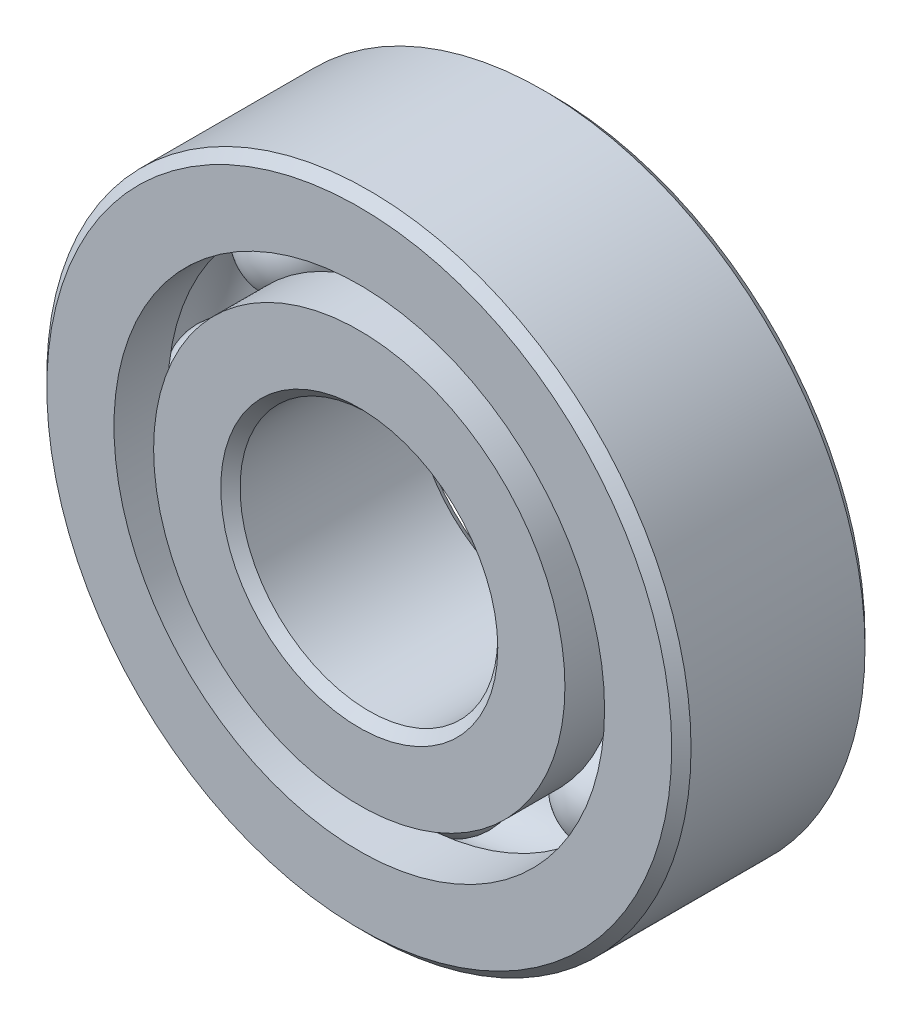
ISO-10303-21;
HEADER;
FILE_DESCRIPTION(('STEP AP214'),'2;1');
FILE_NAME('part.step','',(''),(''),'','','');
FILE_SCHEMA(('AUTOMOTIVE_DESIGN { 1 0 10303 214 1 1 1 1 }'));
ENDSEC;
DATA;
#1=APPLICATION_CONTEXT('core data for automotive mechanical design processes');
#2=APPLICATION_PROTOCOL_DEFINITION('international standard','automotive_design',2000,#1);
#3=PRODUCT_CONTEXT('',#1,'mechanical');
#4=PRODUCT('Part','Part','',(#3));
#5=PRODUCT_RELATED_PRODUCT_CATEGORY('part','',(#4));
#6=PRODUCT_DEFINITION_FORMATION('','',#4);
#7=PRODUCT_DEFINITION_CONTEXT('part definition',#1,'design');
#8=PRODUCT_DEFINITION('design','',#6,#7);
#9=PRODUCT_DEFINITION_SHAPE('','',#8);
#10=(LENGTH_UNIT() NAMED_UNIT(*) SI_UNIT(.MILLI.,.METRE.));
#11=(NAMED_UNIT(*) PLANE_ANGLE_UNIT() SI_UNIT($,.RADIAN.));
#12=(NAMED_UNIT(*) SI_UNIT($,.STERADIAN.) SOLID_ANGLE_UNIT());
#13=UNCERTAINTY_MEASURE_WITH_UNIT(LENGTH_MEASURE(1.E-05),#10,'distance_accuracy_value','');
#14=(GEOMETRIC_REPRESENTATION_CONTEXT(3) GLOBAL_UNCERTAINTY_ASSIGNED_CONTEXT((#13)) GLOBAL_UNIT_ASSIGNED_CONTEXT((#10,
#11,#12)) REPRESENTATION_CONTEXT('',''));
#15=CARTESIAN_POINT('',(0.,0.,0.));
#16=DIRECTION('',(0.,0.,1.));
#17=DIRECTION('',(1.,0.,0.));
#18=AXIS2_PLACEMENT_3D('',#15,#16,#17);
#19=CARTESIAN_POINT('',(-3.92886205296771,3.9288620529678,0.));
#20=DIRECTION('',(0.,0.,1.));
#21=DIRECTION('',(-0.707106781186539,0.707106781186556,0.));
#22=AXIS2_PLACEMENT_3D('',#19,#20,#21);
#23=SPHERICAL_SURFACE('',#22,1.1656174839975);
#24=CARTESIAN_POINT('',(-3.92886205296771,3.9288620529678,1.16561748399749));
#25=VERTEX_POINT('',#24);
#26=VERTEX_LOOP('',#25);
#27=FACE_BOUND('',#26,.T.);
#28=ADVANCED_FACE('F39',(#27),#23,.T.);
#29=CLOSED_SHELL('',(#28));
#30=MANIFOLD_SOLID_BREP('B2',#29);
#31=CARTESIAN_POINT('',(-5.55625,0.,0.));
#32=DIRECTION('',(0.,0.,1.));
#33=DIRECTION('',(-1.,0.,0.));
#34=AXIS2_PLACEMENT_3D('',#31,#32,#33);
#35=SPHERICAL_SURFACE('',#34,1.1656174839975);
#36=CARTESIAN_POINT('',(-5.55625,0.,1.16561748399749));
#37=VERTEX_POINT('',#36);
#38=VERTEX_LOOP('',#37);
#39=FACE_BOUND('',#38,.T.);
#40=ADVANCED_FACE('F59',(#39),#35,.T.);
#41=CLOSED_SHELL('',(#40));
#42=MANIFOLD_SOLID_BREP('B6',#41);
#43=CARTESIAN_POINT('',(-3.92886205296779,-3.92886205296772,0.));
#44=DIRECTION('',(0.,0.,1.));
#45=DIRECTION('',(-0.707106781186554,-0.707106781186541,0.));
#46=AXIS2_PLACEMENT_3D('',#43,#44,#45);
#47=SPHERICAL_SURFACE('',#46,1.1656174839975);
#48=CARTESIAN_POINT('',(-3.92886205296779,-3.92886205296772,1.16561748399749));
#49=VERTEX_POINT('',#48);
#50=VERTEX_LOOP('',#49);
#51=FACE_BOUND('',#50,.T.);
#52=ADVANCED_FACE('F79',(#51),#47,.T.);
#53=CLOSED_SHELL('',(#52));
#54=MANIFOLD_SOLID_BREP('B35',#53);
#55=CARTESIAN_POINT('',(0.,-5.55625,0.));
#56=DIRECTION('',(0.,0.,1.));
#57=DIRECTION('',(0.,-1.,0.));
#58=AXIS2_PLACEMENT_3D('',#55,#56,#57);
#59=SPHERICAL_SURFACE('',#58,1.1656174839975);
#60=CARTESIAN_POINT('',(0.,-5.55625,1.16561748399749));
#61=VERTEX_POINT('',#60);
#62=VERTEX_LOOP('',#61);
#63=FACE_BOUND('',#62,.T.);
#64=ADVANCED_FACE('F99',(#63),#59,.T.);
#65=CLOSED_SHELL('',(#64));
#66=MANIFOLD_SOLID_BREP('B55',#65);
#67=CARTESIAN_POINT('',(3.92886205296773,-3.92886205296777,0.));
#68=DIRECTION('',(0.,0.,1.));
#69=DIRECTION('',(0.707106781186544,-0.707106781186551,0.));
#70=AXIS2_PLACEMENT_3D('',#67,#68,#69);
#71=SPHERICAL_SURFACE('',#70,1.1656174839975);
#72=CARTESIAN_POINT('',(3.92886205296773,-3.92886205296777,1.16561748399749));
#73=VERTEX_POINT('',#72);
#74=VERTEX_LOOP('',#73);
#75=FACE_BOUND('',#74,.T.);
#76=ADVANCED_FACE('F119',(#75),#71,.T.);
#77=CLOSED_SHELL('',(#76));
#78=MANIFOLD_SOLID_BREP('B75',#77);
#79=CARTESIAN_POINT('',(5.55625,0.,0.));
#80=DIRECTION('',(0.,0.,1.));
#81=DIRECTION('',(1.,0.,0.));
#82=AXIS2_PLACEMENT_3D('',#79,#80,#81);
#83=SPHERICAL_SURFACE('',#82,1.1656174839975);
#84=CARTESIAN_POINT('',(5.55625,0.,1.16561748399749));
#85=VERTEX_POINT('',#84);
#86=VERTEX_LOOP('',#85);
#87=FACE_BOUND('',#86,.T.);
#88=ADVANCED_FACE('F139',(#87),#83,.T.);
#89=CLOSED_SHELL('',(#88));
#90=MANIFOLD_SOLID_BREP('B95',#89);
#91=CARTESIAN_POINT('',(3.92886205296776,3.92886205296775,0.));
#92=DIRECTION('',(0.,0.,1.));
#93=DIRECTION('',(0.707106781186549,0.707106781186546,0.));
#94=AXIS2_PLACEMENT_3D('',#91,#92,#93);
#95=SPHERICAL_SURFACE('',#94,1.1656174839975);
#96=CARTESIAN_POINT('',(3.92886205296776,3.92886205296775,1.16561748399749));
#97=VERTEX_POINT('',#96);
#98=VERTEX_LOOP('',#97);
#99=FACE_BOUND('',#98,.T.);
#100=ADVANCED_FACE('F159',(#99),#95,.T.);
#101=CLOSED_SHELL('',(#100));
#102=MANIFOLD_SOLID_BREP('B115',#101);
#103=CARTESIAN_POINT('',(0.,5.55625,0.));
#104=DIRECTION('',(0.,0.,1.));
#105=DIRECTION('',(0.,1.,0.));
#106=AXIS2_PLACEMENT_3D('',#103,#104,#105);
#107=SPHERICAL_SURFACE('',#106,1.1656174839975);
#108=CARTESIAN_POINT('',(0.,5.55625,1.16561748399749));
#109=VERTEX_POINT('',#108);
#110=VERTEX_LOOP('',#109);
#111=FACE_BOUND('',#110,.T.);
#112=ADVANCED_FACE('F181',(#111),#107,.T.);
#113=CLOSED_SHELL('',(#112));
#114=MANIFOLD_SOLID_BREP('B135',#113);
#115=CARTESIAN_POINT('',(0.,5.06778846153847,2.38125));
#116=DIRECTION('',(0.,0.,-1.));
#117=DIRECTION('',(-1.,0.,0.));
#118=AXIS2_PLACEMENT_3D('',#115,#116,#117);
#119=PLANE('',#118);
#120=CARTESIAN_POINT('',(0.,0.,2.38125));
#121=DIRECTION('',(0.,0.,1.));
#122=DIRECTION('',(1.,0.,0.));
#123=AXIS2_PLACEMENT_3D('',#120,#121,#122);
#124=CIRCLE('',#123,3.413125);
#125=CARTESIAN_POINT('',(3.413125,0.,2.38125));
#126=VERTEX_POINT('',#125);
#127=EDGE_CURVE('E228',#126,#126,#124,.T.);
#128=ORIENTED_EDGE('',*,*,#127,.F.);
#129=EDGE_LOOP('',(#128));
#130=FACE_BOUND('',#129,.T.);
#131=CARTESIAN_POINT('',(0.,0.,2.38125));
#132=DIRECTION('',(0.,0.,1.));
#133=DIRECTION('',(1.,0.,0.));
#134=AXIS2_PLACEMENT_3D('',#131,#132,#133);
#135=CIRCLE('',#134,5.06778846153847);
#136=CARTESIAN_POINT('',(5.06778846153847,0.,2.38125));
#137=VERTEX_POINT('',#136);
#138=EDGE_CURVE('E180',#137,#137,#135,.T.);
#139=ORIENTED_EDGE('',*,*,#138,.T.);
#140=EDGE_LOOP('',(#139));
#141=FACE_BOUND('',#140,.T.);
#142=ADVANCED_FACE('F200',(#130,#141),#119,.F.);
#143=CARTESIAN_POINT('',(0.,0.,2.38125));
#144=DIRECTION('',(0.,0.,1.));
#145=DIRECTION('',(1.,0.,0.));
#146=AXIS2_PLACEMENT_3D('',#143,#144,#145);
#147=CYLINDRICAL_SURFACE('',#146,5.06778846153847);
#148=ORIENTED_EDGE('',*,*,#138,.F.);
#149=EDGE_LOOP('',(#148));
#150=FACE_BOUND('',#149,.T.);
#151=CARTESIAN_POINT('',(0.,0.,1.05833333333333));
#152=DIRECTION('',(0.,0.,1.));
#153=DIRECTION('',(1.,0.,0.));
#154=AXIS2_PLACEMENT_3D('',#151,#152,#153);
#155=CIRCLE('',#154,5.06778846153847);
#156=CARTESIAN_POINT('',(5.06778846153847,0.,1.05833333333333));
#157=VERTEX_POINT('',#156);
#158=EDGE_CURVE('E206',#157,#157,#155,.T.);
#159=ORIENTED_EDGE('',*,*,#158,.T.);
#160=EDGE_LOOP('',(#159));
#161=FACE_BOUND('',#160,.T.);
#162=ADVANCED_FACE('F235',(#150,#161),#147,.T.);
#163=CARTESIAN_POINT('',(0.,0.,0.));
#164=DIRECTION('',(0.,0.,1.));
#165=DIRECTION('',(1.,0.,0.));
#166=AXIS2_PLACEMENT_3D('',#163,#164,#165);
#167=TOROIDAL_SURFACE('',#166,5.55625,1.16561748399749);
#168=ORIENTED_EDGE('',*,*,#158,.F.);
#169=EDGE_LOOP('',(#168));
#170=FACE_BOUND('',#169,.T.);
#171=CARTESIAN_POINT('',(0.,0.,-1.05833333333333));
#172=DIRECTION('',(0.,0.,1.));
#173=DIRECTION('',(1.,0.,0.));
#174=AXIS2_PLACEMENT_3D('',#171,#172,#173);
#175=CIRCLE('',#174,5.06778846153847);
#176=CARTESIAN_POINT('',(5.06778846153847,0.,-1.05833333333333));
#177=VERTEX_POINT('',#176);
#178=EDGE_CURVE('E210',#177,#177,#175,.T.);
#179=ORIENTED_EDGE('',*,*,#178,.T.);
#180=EDGE_LOOP('',(#179));
#181=FACE_BOUND('',#180,.T.);
#182=ADVANCED_FACE('F239',(#170,#181),#167,.F.);
#183=CARTESIAN_POINT('',(0.,0.,2.38125));
#184=DIRECTION('',(0.,0.,1.));
#185=DIRECTION('',(1.,0.,0.));
#186=AXIS2_PLACEMENT_3D('',#183,#184,#185);
#187=CYLINDRICAL_SURFACE('',#186,5.06778846153847);
#188=ORIENTED_EDGE('',*,*,#178,.F.);
#189=EDGE_LOOP('',(#188));
#190=FACE_BOUND('',#189,.T.);
#191=CARTESIAN_POINT('',(0.,0.,-2.38125));
#192=DIRECTION('',(0.,0.,1.));
#193=DIRECTION('',(1.,0.,0.));
#194=AXIS2_PLACEMENT_3D('',#191,#192,#193);
#195=CIRCLE('',#194,5.06778846153847);
#196=CARTESIAN_POINT('',(5.06778846153847,0.,-2.38125));
#197=VERTEX_POINT('',#196);
#198=EDGE_CURVE('E214',#197,#197,#195,.T.);
#199=ORIENTED_EDGE('',*,*,#198,.T.);
#200=EDGE_LOOP('',(#199));
#201=FACE_BOUND('',#200,.T.);
#202=ADVANCED_FACE('F244',(#190,#201),#187,.T.);
#203=CARTESIAN_POINT('',(0.,3.413125,-2.38125000000001));
#204=DIRECTION('',(0.,0.,1.));
#205=DIRECTION('',(1.,0.,0.));
#206=AXIS2_PLACEMENT_3D('',#203,#204,#205);
#207=PLANE('',#206);
#208=ORIENTED_EDGE('',*,*,#198,.F.);
#209=EDGE_LOOP('',(#208));
#210=FACE_BOUND('',#209,.T.);
#211=CARTESIAN_POINT('',(0.,0.,-2.38125000000001));
#212=DIRECTION('',(0.,0.,1.));
#213=DIRECTION('',(1.,0.,0.));
#214=AXIS2_PLACEMENT_3D('',#211,#212,#213);
#215=CIRCLE('',#214,3.413125);
#216=CARTESIAN_POINT('',(3.413125,0.,-2.38125000000001));
#217=VERTEX_POINT('',#216);
#218=EDGE_CURVE('E219',#217,#217,#215,.T.);
#219=ORIENTED_EDGE('',*,*,#218,.T.);
#220=EDGE_LOOP('',(#219));
#221=FACE_BOUND('',#220,.T.);
#222=ADVANCED_FACE('F250',(#210,#221),#207,.F.);
#223=CARTESIAN_POINT('',(0.,0.,-2.14312500000001));
#224=DIRECTION('',(0.,0.,-1.));
#225=DIRECTION('',(-1.,0.,0.));
#226=AXIS2_PLACEMENT_3D('',#223,#224,#225);
#227=CONICAL_SURFACE('',#226,3.175,0.785398163397448);
#228=ORIENTED_EDGE('',*,*,#218,.F.);
#229=EDGE_LOOP('',(#228));
#230=FACE_BOUND('',#229,.T.);
#231=CARTESIAN_POINT('',(0.,0.,-2.14312500000001));
#232=DIRECTION('',(0.,0.,1.));
#233=DIRECTION('',(1.,0.,0.));
#234=AXIS2_PLACEMENT_3D('',#231,#232,#233);
#235=CIRCLE('',#234,3.175);
#236=CARTESIAN_POINT('',(3.175,0.,-2.14312500000001));
#237=VERTEX_POINT('',#236);
#238=EDGE_CURVE('E222',#237,#237,#235,.T.);
#239=ORIENTED_EDGE('',*,*,#238,.T.);
#240=EDGE_LOOP('',(#239));
#241=FACE_BOUND('',#240,.T.);
#242=ADVANCED_FACE('F254',(#230,#241),#227,.F.);
#243=CARTESIAN_POINT('',(0.,0.,2.38125));
#244=DIRECTION('',(0.,0.,1.));
#245=DIRECTION('',(1.,0.,0.));
#246=AXIS2_PLACEMENT_3D('',#243,#244,#245);
#247=CYLINDRICAL_SURFACE('',#246,3.175);
#248=ORIENTED_EDGE('',*,*,#238,.F.);
#249=EDGE_LOOP('',(#248));
#250=FACE_BOUND('',#249,.T.);
#251=CARTESIAN_POINT('',(0.,0.,2.143125));
#252=DIRECTION('',(0.,0.,1.));
#253=DIRECTION('',(1.,0.,0.));
#254=AXIS2_PLACEMENT_3D('',#251,#252,#253);
#255=CIRCLE('',#254,3.175);
#256=CARTESIAN_POINT('',(3.175,0.,2.143125));
#257=VERTEX_POINT('',#256);
#258=EDGE_CURVE('E225',#257,#257,#255,.T.);
#259=ORIENTED_EDGE('',*,*,#258,.T.);
#260=EDGE_LOOP('',(#259));
#261=FACE_BOUND('',#260,.T.);
#262=ADVANCED_FACE('F258',(#250,#261),#247,.F.);
#263=CARTESIAN_POINT('',(0.,0.,2.38125));
#264=DIRECTION('',(0.,0.,1.));
#265=DIRECTION('',(1.,0.,0.));
#266=AXIS2_PLACEMENT_3D('',#263,#264,#265);
#267=CONICAL_SURFACE('',#266,3.413125,0.785398163397448);
#268=ORIENTED_EDGE('',*,*,#258,.F.);
#269=EDGE_LOOP('',(#268));
#270=FACE_BOUND('',#269,.T.);
#271=ORIENTED_EDGE('',*,*,#127,.T.);
#272=EDGE_LOOP('',(#271));
#273=FACE_BOUND('',#272,.T.);
#274=ADVANCED_FACE('F232',(#270,#273),#267,.F.);
#275=CLOSED_SHELL('',(#142,#162,#182,#202,#222,#242,#262,#274));
#276=MANIFOLD_SOLID_BREP('B155',#275);
#277=CARTESIAN_POINT('',(0.,0.,2.143125));
#278=DIRECTION('',(0.,0.,-1.));
#279=DIRECTION('',(-1.,0.,0.));
#280=AXIS2_PLACEMENT_3D('',#277,#278,#279);
#281=CONICAL_SURFACE('',#280,7.9375,0.785398163397448);
#282=CARTESIAN_POINT('',(0.,0.,2.38125));
#283=DIRECTION('',(0.,0.,1.));
#284=DIRECTION('',(1.,0.,0.));
#285=AXIS2_PLACEMENT_3D('',#282,#283,#284);
#286=CIRCLE('',#285,7.699375);
#287=CARTESIAN_POINT('',(7.699375,0.,2.38125));
#288=VERTEX_POINT('',#287);
#289=EDGE_CURVE('E349',#288,#288,#286,.T.);
#290=ORIENTED_EDGE('',*,*,#289,.F.);
#291=EDGE_LOOP('',(#290));
#292=FACE_BOUND('',#291,.T.);
#293=CARTESIAN_POINT('',(0.,0.,2.143125));
#294=DIRECTION('',(0.,0.,1.));
#295=DIRECTION('',(1.,0.,0.));
#296=AXIS2_PLACEMENT_3D('',#293,#294,#295);
#297=CIRCLE('',#296,7.9375);
#298=CARTESIAN_POINT('',(7.9375,0.,2.143125));
#299=VERTEX_POINT('',#298);
#300=EDGE_CURVE('E199',#299,#299,#297,.T.);
#301=ORIENTED_EDGE('',*,*,#300,.T.);
#302=EDGE_LOOP('',(#301));
#303=FACE_BOUND('',#302,.T.);
#304=ADVANCED_FACE('F321',(#292,#303),#281,.T.);
#305=CARTESIAN_POINT('',(0.,0.,2.38125));
#306=DIRECTION('',(0.,0.,1.));
#307=DIRECTION('',(1.,0.,0.));
#308=AXIS2_PLACEMENT_3D('',#305,#306,#307);
#309=CYLINDRICAL_SURFACE('',#308,7.9375);
#310=ORIENTED_EDGE('',*,*,#300,.F.);
#311=EDGE_LOOP('',(#310));
#312=FACE_BOUND('',#311,.T.);
#313=CARTESIAN_POINT('',(0.,0.,-2.14312500000001));
#314=DIRECTION('',(0.,0.,1.));
#315=DIRECTION('',(1.,0.,0.));
#316=AXIS2_PLACEMENT_3D('',#313,#314,#315);
#317=CIRCLE('',#316,7.9375);
#318=CARTESIAN_POINT('',(7.9375,0.,-2.14312500000001));
#319=VERTEX_POINT('',#318);
#320=EDGE_CURVE('E327',#319,#319,#317,.T.);
#321=ORIENTED_EDGE('',*,*,#320,.T.);
#322=EDGE_LOOP('',(#321));
#323=FACE_BOUND('',#322,.T.);
#324=ADVANCED_FACE('F356',(#312,#323),#309,.T.);
#325=CARTESIAN_POINT('',(0.,0.,-2.38125000000001));
#326=DIRECTION('',(0.,0.,1.));
#327=DIRECTION('',(1.,0.,0.));
#328=AXIS2_PLACEMENT_3D('',#325,#326,#327);
#329=CONICAL_SURFACE('',#328,7.699375,0.785398163397448);
#330=ORIENTED_EDGE('',*,*,#320,.F.);
#331=EDGE_LOOP('',(#330));
#332=FACE_BOUND('',#331,.T.);
#333=CARTESIAN_POINT('',(0.,0.,-2.38125000000001));
#334=DIRECTION('',(0.,0.,1.));
#335=DIRECTION('',(1.,0.,0.));
#336=AXIS2_PLACEMENT_3D('',#333,#334,#335);
#337=CIRCLE('',#336,7.699375);
#338=CARTESIAN_POINT('',(7.699375,0.,-2.38125000000001));
#339=VERTEX_POINT('',#338);
#340=EDGE_CURVE('E331',#339,#339,#337,.T.);
#341=ORIENTED_EDGE('',*,*,#340,.T.);
#342=EDGE_LOOP('',(#341));
#343=FACE_BOUND('',#342,.T.);
#344=ADVANCED_FACE('F360',(#332,#343),#329,.T.);
#345=CARTESIAN_POINT('',(0.,7.699375,-2.38125000000001));
#346=DIRECTION('',(0.,0.,1.));
#347=DIRECTION('',(1.,0.,0.));
#348=AXIS2_PLACEMENT_3D('',#345,#346,#347);
#349=PLANE('',#348);
#350=ORIENTED_EDGE('',*,*,#340,.F.);
#351=EDGE_LOOP('',(#350));
#352=FACE_BOUND('',#351,.T.);
#353=CARTESIAN_POINT('',(0.,0.,-2.38125000000001));
#354=DIRECTION('',(0.,0.,1.));
#355=DIRECTION('',(1.,0.,0.));
#356=AXIS2_PLACEMENT_3D('',#353,#354,#355);
#357=CIRCLE('',#356,6.04471153846153);
#358=CARTESIAN_POINT('',(6.04471153846153,0.,-2.38125000000001));
#359=VERTEX_POINT('',#358);
#360=EDGE_CURVE('E335',#359,#359,#357,.T.);
#361=ORIENTED_EDGE('',*,*,#360,.T.);
#362=EDGE_LOOP('',(#361));
#363=FACE_BOUND('',#362,.T.);
#364=ADVANCED_FACE('F365',(#352,#363),#349,.F.);
#365=CARTESIAN_POINT('',(0.,0.,2.38125));
#366=DIRECTION('',(0.,0.,1.));
#367=DIRECTION('',(1.,0.,0.));
#368=AXIS2_PLACEMENT_3D('',#365,#366,#367);
#369=CYLINDRICAL_SURFACE('',#368,6.04471153846153);
#370=ORIENTED_EDGE('',*,*,#360,.F.);
#371=EDGE_LOOP('',(#370));
#372=FACE_BOUND('',#371,.T.);
#373=CARTESIAN_POINT('',(0.,0.,-1.05833333333334));
#374=DIRECTION('',(0.,0.,1.));
#375=DIRECTION('',(1.,0.,0.));
#376=AXIS2_PLACEMENT_3D('',#373,#374,#375);
#377=CIRCLE('',#376,6.04471153846153);
#378=CARTESIAN_POINT('',(6.04471153846153,0.,-1.05833333333334));
#379=VERTEX_POINT('',#378);
#380=EDGE_CURVE('E340',#379,#379,#377,.T.);
#381=ORIENTED_EDGE('',*,*,#380,.T.);
#382=EDGE_LOOP('',(#381));
#383=FACE_BOUND('',#382,.T.);
#384=ADVANCED_FACE('F371',(#372,#383),#369,.F.);
#385=CARTESIAN_POINT('',(0.,0.,0.));
#386=DIRECTION('',(0.,0.,1.));
#387=DIRECTION('',(1.,0.,0.));
#388=AXIS2_PLACEMENT_3D('',#385,#386,#387);
#389=TOROIDAL_SURFACE('',#388,5.55625,1.1656174839975);
#390=ORIENTED_EDGE('',*,*,#380,.F.);
#391=EDGE_LOOP('',(#390));
#392=FACE_BOUND('',#391,.T.);
#393=CARTESIAN_POINT('',(0.,0.,1.05833333333333));
#394=DIRECTION('',(0.,0.,1.));
#395=DIRECTION('',(1.,0.,0.));
#396=AXIS2_PLACEMENT_3D('',#393,#394,#395);
#397=CIRCLE('',#396,6.04471153846153);
#398=CARTESIAN_POINT('',(6.04471153846153,0.,1.05833333333333));
#399=VERTEX_POINT('',#398);
#400=EDGE_CURVE('E343',#399,#399,#397,.T.);
#401=ORIENTED_EDGE('',*,*,#400,.T.);
#402=EDGE_LOOP('',(#401));
#403=FACE_BOUND('',#402,.T.);
#404=ADVANCED_FACE('F375',(#392,#403),#389,.F.);
#405=CARTESIAN_POINT('',(0.,0.,2.38125));
#406=DIRECTION('',(0.,0.,1.));
#407=DIRECTION('',(1.,0.,0.));
#408=AXIS2_PLACEMENT_3D('',#405,#406,#407);
#409=CYLINDRICAL_SURFACE('',#408,6.04471153846153);
#410=ORIENTED_EDGE('',*,*,#400,.F.);
#411=EDGE_LOOP('',(#410));
#412=FACE_BOUND('',#411,.T.);
#413=CARTESIAN_POINT('',(0.,0.,2.38125));
#414=DIRECTION('',(0.,0.,1.));
#415=DIRECTION('',(1.,0.,0.));
#416=AXIS2_PLACEMENT_3D('',#413,#414,#415);
#417=CIRCLE('',#416,6.04471153846153);
#418=CARTESIAN_POINT('',(6.04471153846153,0.,2.38125));
#419=VERTEX_POINT('',#418);
#420=EDGE_CURVE('E346',#419,#419,#417,.T.);
#421=ORIENTED_EDGE('',*,*,#420,.T.);
#422=EDGE_LOOP('',(#421));
#423=FACE_BOUND('',#422,.T.);
#424=ADVANCED_FACE('F379',(#412,#423),#409,.F.);
#425=CARTESIAN_POINT('',(0.,7.699375,2.38125));
#426=DIRECTION('',(0.,0.,-1.));
#427=DIRECTION('',(-1.,0.,0.));
#428=AXIS2_PLACEMENT_3D('',#425,#426,#427);
#429=PLANE('',#428);
#430=ORIENTED_EDGE('',*,*,#420,.F.);
#431=EDGE_LOOP('',(#430));
#432=FACE_BOUND('',#431,.T.);
#433=ORIENTED_EDGE('',*,*,#289,.T.);
#434=EDGE_LOOP('',(#433));
#435=FACE_BOUND('',#434,.T.);
#436=ADVANCED_FACE('F353',(#432,#435),#429,.F.);
#437=CLOSED_SHELL('',(#304,#324,#344,#364,#384,#404,#424,#436));
#438=MANIFOLD_SOLID_BREP('B175',#437);
#439=ADVANCED_BREP_SHAPE_REPRESENTATION('',(#18,#30,#42,#54,#66,#78,#90,#102,#114,#276,#438),#14);
#440=SHAPE_DEFINITION_REPRESENTATION(#9,#439);
ENDSEC;
END-ISO-10303-21;
